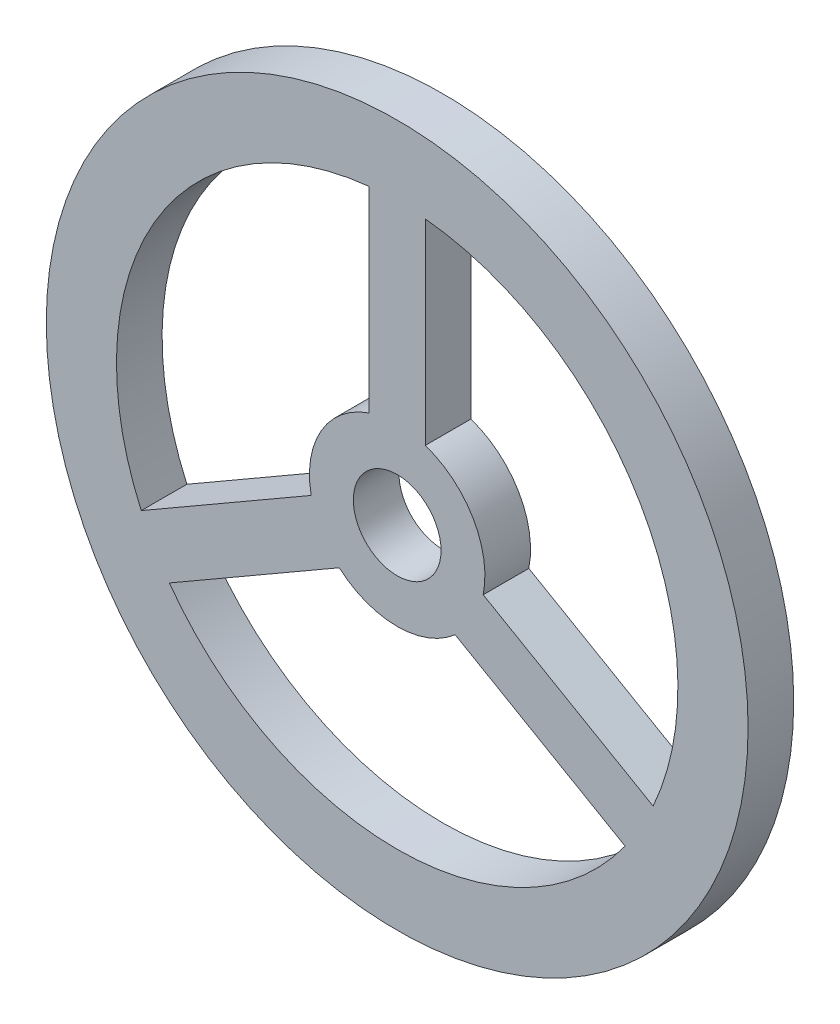
ISO-10303-21;
HEADER;
FILE_DESCRIPTION(('STEP AP214'),'2;1');
FILE_NAME('part.step','',(''),(''),'','','');
FILE_SCHEMA(('AUTOMOTIVE_DESIGN { 1 0 10303 214 1 1 1 1 }'));
ENDSEC;
DATA;
#1=APPLICATION_CONTEXT('core data for automotive mechanical design processes');
#2=APPLICATION_PROTOCOL_DEFINITION('international standard','automotive_design',2000,#1);
#3=PRODUCT_CONTEXT('',#1,'mechanical');
#4=PRODUCT('Part','Part','',(#3));
#5=PRODUCT_RELATED_PRODUCT_CATEGORY('part','',(#4));
#6=PRODUCT_DEFINITION_FORMATION('','',#4);
#7=PRODUCT_DEFINITION_CONTEXT('part definition',#1,'design');
#8=PRODUCT_DEFINITION('design','',#6,#7);
#9=PRODUCT_DEFINITION_SHAPE('','',#8);
#10=(LENGTH_UNIT() NAMED_UNIT(*) SI_UNIT(.MILLI.,.METRE.));
#11=(NAMED_UNIT(*) PLANE_ANGLE_UNIT() SI_UNIT($,.RADIAN.));
#12=(NAMED_UNIT(*) SI_UNIT($,.STERADIAN.) SOLID_ANGLE_UNIT());
#13=UNCERTAINTY_MEASURE_WITH_UNIT(LENGTH_MEASURE(1.E-05),#10,'distance_accuracy_value','');
#14=(GEOMETRIC_REPRESENTATION_CONTEXT(3) GLOBAL_UNCERTAINTY_ASSIGNED_CONTEXT((#13)) GLOBAL_UNIT_ASSIGNED_CONTEXT((#10,
#11,#12)) REPRESENTATION_CONTEXT('',''));
#15=CARTESIAN_POINT('',(0.,0.,0.));
#16=DIRECTION('',(0.,0.,1.));
#17=DIRECTION('',(1.,0.,0.));
#18=AXIS2_PLACEMENT_3D('',#15,#16,#17);
#19=CARTESIAN_POINT('',(0.,0.,1.3));
#20=DIRECTION('',(0.,0.,-1.));
#21=DIRECTION('',(-1.,0.,0.));
#22=AXIS2_PLACEMENT_3D('',#19,#20,#21);
#23=CYLINDRICAL_SURFACE('',#22,10.);
#24=CARTESIAN_POINT('',(0.,0.,1.3));
#25=DIRECTION('',(0.,0.,1.));
#26=DIRECTION('',(1.,0.,0.));
#27=AXIS2_PLACEMENT_3D('',#24,#25,#26);
#28=CIRCLE('',#27,10.);
#29=CARTESIAN_POINT('',(10.,0.,1.3));
#30=VERTEX_POINT('',#29);
#31=EDGE_CURVE('E11',#30,#30,#28,.T.);
#32=ORIENTED_EDGE('',*,*,#31,.F.);
#33=EDGE_LOOP('',(#32));
#34=FACE_BOUND('',#33,.T.);
#35=CARTESIAN_POINT('',(0.,0.,0.));
#36=DIRECTION('',(0.,0.,1.));
#37=DIRECTION('',(1.,0.,0.));
#38=AXIS2_PLACEMENT_3D('',#35,#36,#37);
#39=CIRCLE('',#38,10.);
#40=CARTESIAN_POINT('',(10.,0.,0.));
#41=VERTEX_POINT('',#40);
#42=EDGE_CURVE('E39',#41,#41,#39,.T.);
#43=ORIENTED_EDGE('',*,*,#42,.T.);
#44=EDGE_LOOP('',(#43));
#45=FACE_BOUND('',#44,.T.);
#46=ADVANCED_FACE('F36',(#34,#45),#23,.T.);
#47=CARTESIAN_POINT('',(0.,0.,1.3));
#48=DIRECTION('',(0.,0.,1.));
#49=DIRECTION('',(1.,0.,0.));
#50=AXIS2_PLACEMENT_3D('',#47,#48,#49);
#51=PLANE('',#50);
#52=CARTESIAN_POINT('',(0.,0.,1.3));
#53=DIRECTION('',(0.,0.,1.));
#54=DIRECTION('',(1.,0.,0.));
#55=AXIS2_PLACEMENT_3D('',#52,#53,#54);
#56=CIRCLE('',#55,1.25);
#57=CARTESIAN_POINT('',(1.25,0.,1.3));
#58=VERTEX_POINT('',#57);
#59=EDGE_CURVE('E151',#58,#58,#56,.T.);
#60=ORIENTED_EDGE('',*,*,#59,.F.);
#61=EDGE_LOOP('',(#60));
#62=FACE_BOUND('',#61,.T.);
#63=CARTESIAN_POINT('',(0.,0.,1.3));
#64=DIRECTION('',(0.,0.,1.));
#65=DIRECTION('',(1.,0.,0.));
#66=AXIS2_PLACEMENT_3D('',#63,#64,#65);
#67=CIRCLE('',#66,8.00000000000027);
#68=CARTESIAN_POINT('',(-6.49347517584585,-4.67277007145419,1.3));
#69=VERTEX_POINT('',#68);
#70=CARTESIAN_POINT('',(6.49347517584591,-4.6727700714541,1.3));
#71=VERTEX_POINT('',#70);
#72=EDGE_CURVE('E50',#69,#71,#67,.T.);
#73=ORIENTED_EDGE('',*,*,#72,.F.);
#74=DIRECTION('',(-0.866025403784436,-0.500000000000004,0.));
#75=VECTOR('',#74,1.);
#76=CARTESIAN_POINT('',(-6.49347517584585,-4.67277007145419,1.3));
#77=LINE('',#76,#75);
#78=CARTESIAN_POINT('',(-1.65121914967683,-1.87709225126039,1.3));
#79=VERTEX_POINT('',#78);
#80=EDGE_CURVE('E171',#79,#69,#77,.T.);
#81=ORIENTED_EDGE('',*,*,#80,.F.);
#82=CARTESIAN_POINT('',(0.,0.,1.3));
#83=DIRECTION('',(0.,0.,-1.));
#84=DIRECTION('',(1.,0.,0.));
#85=AXIS2_PLACEMENT_3D('',#82,#83,#84);
#86=CIRCLE('',#85,2.50000000000026);
#87=CARTESIAN_POINT('',(1.65121914967685,-1.87709225126037,1.3));
#88=VERTEX_POINT('',#87);
#89=EDGE_CURVE('E185',#88,#79,#86,.T.);
#90=ORIENTED_EDGE('',*,*,#89,.F.);
#91=DIRECTION('',(-0.866025403784444,0.499999999999991,0.));
#92=VECTOR('',#91,1.);
#93=CARTESIAN_POINT('',(6.49347517584591,-4.6727700714541,1.3));
#94=LINE('',#93,#92);
#95=EDGE_CURVE('E182',#71,#88,#94,.T.);
#96=ORIENTED_EDGE('',*,*,#95,.F.);
#97=EDGE_LOOP('',(#73,#81,#90,#96));
#98=FACE_BOUND('',#97,.T.);
#99=CARTESIAN_POINT('',(0.,0.,1.3));
#100=DIRECTION('',(0.,0.,-1.));
#101=DIRECTION('',(1.,0.,0.));
#102=AXIS2_PLACEMENT_3D('',#99,#100,#101);
#103=CIRCLE('',#102,2.50000000000021);
#104=CARTESIAN_POINT('',(0.800000000000001,2.36854385646557,1.3));
#105=VERTEX_POINT('',#104);
#106=CARTESIAN_POINT('',(2.45121914967684,-0.491451605205262,1.3));
#107=VERTEX_POINT('',#106);
#108=EDGE_CURVE('E58',#105,#107,#103,.T.);
#109=ORIENTED_EDGE('',*,*,#108,.F.);
#110=DIRECTION('',(0.,-1.,0.));
#111=VECTOR('',#110,1.);
#112=CARTESIAN_POINT('',(0.800000000000001,2.36854385646557,1.3));
#113=LINE('',#112,#111);
#114=CARTESIAN_POINT('',(0.800000000000007,7.95989949685317,1.3));
#115=VERTEX_POINT('',#114);
#116=EDGE_CURVE('E145',#115,#105,#113,.T.);
#117=ORIENTED_EDGE('',*,*,#116,.F.);
#118=CARTESIAN_POINT('',(0.,0.,1.3));
#119=DIRECTION('',(0.,0.,1.));
#120=DIRECTION('',(1.,0.,0.));
#121=AXIS2_PLACEMENT_3D('',#118,#119,#120);
#122=CIRCLE('',#121,8.00000000000021);
#123=CARTESIAN_POINT('',(7.2934751758459,-3.28712942539899,1.3));
#124=VERTEX_POINT('',#123);
#125=EDGE_CURVE('E148',#124,#115,#122,.T.);
#126=ORIENTED_EDGE('',*,*,#125,.F.);
#127=DIRECTION('',(0.866025403784444,-0.499999999999991,0.));
#128=VECTOR('',#127,1.);
#129=CARTESIAN_POINT('',(2.45121914967684,-0.491451605205262,1.3));
#130=LINE('',#129,#128);
#131=EDGE_CURVE('E157',#107,#124,#130,.T.);
#132=ORIENTED_EDGE('',*,*,#131,.F.);
#133=EDGE_LOOP('',(#109,#117,#126,#132));
#134=FACE_BOUND('',#133,.T.);
#135=CARTESIAN_POINT('',(0.,0.,1.3));
#136=DIRECTION('',(0.,0.,1.));
#137=DIRECTION('',(1.,0.,0.));
#138=AXIS2_PLACEMENT_3D('',#135,#136,#137);
#139=CIRCLE('',#138,8.00000000000021);
#140=CARTESIAN_POINT('',(-0.8,7.95989949685312,1.3));
#141=VERTEX_POINT('',#140);
#142=CARTESIAN_POINT('',(-7.29347517584585,-3.28712942539909,1.3));
#143=VERTEX_POINT('',#142);
#144=EDGE_CURVE('E192',#141,#143,#139,.T.);
#145=ORIENTED_EDGE('',*,*,#144,.F.);
#146=DIRECTION('',(0.,1.,0.));
#147=VECTOR('',#146,1.);
#148=CARTESIAN_POINT('',(-0.8,7.95989949685312,1.3));
#149=LINE('',#148,#147);
#150=CARTESIAN_POINT('',(-0.799999999999999,2.36854385646567,1.3));
#151=VERTEX_POINT('',#150);
#152=EDGE_CURVE('E202',#151,#141,#149,.T.);
#153=ORIENTED_EDGE('',*,*,#152,.F.);
#154=CARTESIAN_POINT('',(0.,0.,1.3));
#155=DIRECTION('',(0.,0.,-1.));
#156=DIRECTION('',(1.,0.,0.));
#157=AXIS2_PLACEMENT_3D('',#154,#155,#156);
#158=CIRCLE('',#157,2.50000000000025);
#159=CARTESIAN_POINT('',(-2.45121914967683,-0.491451605205292,1.3));
#160=VERTEX_POINT('',#159);
#161=EDGE_CURVE('E216',#160,#151,#158,.T.);
#162=ORIENTED_EDGE('',*,*,#161,.F.);
#163=DIRECTION('',(0.866025403784436,0.500000000000004,0.));
#164=VECTOR('',#163,1.);
#165=CARTESIAN_POINT('',(-7.29347517584585,-3.28712942539909,1.3));
#166=LINE('',#165,#164);
#167=EDGE_CURVE('E213',#143,#160,#166,.T.);
#168=ORIENTED_EDGE('',*,*,#167,.F.);
#169=EDGE_LOOP('',(#145,#153,#162,#168));
#170=FACE_BOUND('',#169,.T.);
#171=ORIENTED_EDGE('',*,*,#31,.T.);
#172=EDGE_LOOP('',(#171));
#173=FACE_BOUND('',#172,.T.);
#174=ADVANCED_FACE('F238',(#62,#98,#134,#170,#173),#51,.T.);
#175=CARTESIAN_POINT('',(0.,0.,0.));
#176=DIRECTION('',(0.,0.,1.));
#177=DIRECTION('',(1.,0.,0.));
#178=AXIS2_PLACEMENT_3D('',#175,#176,#177);
#179=PLANE('',#178);
#180=CARTESIAN_POINT('',(0.,0.,0.));
#181=DIRECTION('',(0.,0.,1.));
#182=DIRECTION('',(1.,0.,0.));
#183=AXIS2_PLACEMENT_3D('',#180,#181,#182);
#184=CIRCLE('',#183,1.25);
#185=CARTESIAN_POINT('',(1.25,0.,0.));
#186=VERTEX_POINT('',#185);
#187=EDGE_CURVE('E158',#186,#186,#184,.T.);
#188=ORIENTED_EDGE('',*,*,#187,.T.);
#189=EDGE_LOOP('',(#188));
#190=FACE_BOUND('',#189,.T.);
#191=DIRECTION('',(-0.866025403784436,-0.500000000000004,0.));
#192=VECTOR('',#191,1.);
#193=CARTESIAN_POINT('',(-6.49347517584585,-4.67277007145419,0.));
#194=LINE('',#193,#192);
#195=CARTESIAN_POINT('',(-1.65121914967683,-1.87709225126039,0.));
#196=VERTEX_POINT('',#195);
#197=CARTESIAN_POINT('',(-6.49347517584585,-4.67277007145419,0.));
#198=VERTEX_POINT('',#197);
#199=EDGE_CURVE('E177',#196,#198,#194,.T.);
#200=ORIENTED_EDGE('',*,*,#199,.T.);
#201=CARTESIAN_POINT('',(0.,0.,0.));
#202=DIRECTION('',(0.,0.,1.));
#203=DIRECTION('',(1.,0.,0.));
#204=AXIS2_PLACEMENT_3D('',#201,#202,#203);
#205=CIRCLE('',#204,8.00000000000027);
#206=CARTESIAN_POINT('',(6.49347517584591,-4.6727700714541,0.));
#207=VERTEX_POINT('',#206);
#208=EDGE_CURVE('E167',#198,#207,#205,.T.);
#209=ORIENTED_EDGE('',*,*,#208,.T.);
#210=DIRECTION('',(-0.866025403784444,0.499999999999991,0.));
#211=VECTOR('',#210,1.);
#212=CARTESIAN_POINT('',(6.49347517584591,-4.6727700714541,0.));
#213=LINE('',#212,#211);
#214=CARTESIAN_POINT('',(1.65121914967685,-1.87709225126037,0.));
#215=VERTEX_POINT('',#214);
#216=EDGE_CURVE('E170',#207,#215,#213,.T.);
#217=ORIENTED_EDGE('',*,*,#216,.T.);
#218=CARTESIAN_POINT('',(0.,0.,0.));
#219=DIRECTION('',(0.,0.,-1.));
#220=DIRECTION('',(1.,0.,0.));
#221=AXIS2_PLACEMENT_3D('',#218,#219,#220);
#222=CIRCLE('',#221,2.50000000000026);
#223=EDGE_CURVE('E174',#215,#196,#222,.T.);
#224=ORIENTED_EDGE('',*,*,#223,.T.);
#225=EDGE_LOOP('',(#200,#209,#217,#224));
#226=FACE_BOUND('',#225,.T.);
#227=DIRECTION('',(0.,-1.,0.));
#228=VECTOR('',#227,1.);
#229=CARTESIAN_POINT('',(0.800000000000001,2.36854385646557,0.));
#230=LINE('',#229,#228);
#231=CARTESIAN_POINT('',(0.800000000000007,7.95989949685317,0.));
#232=VERTEX_POINT('',#231);
#233=CARTESIAN_POINT('',(0.800000000000001,2.36854385646557,0.));
#234=VERTEX_POINT('',#233);
#235=EDGE_CURVE('E132',#232,#234,#230,.T.);
#236=ORIENTED_EDGE('',*,*,#235,.T.);
#237=CARTESIAN_POINT('',(0.,0.,0.));
#238=DIRECTION('',(0.,0.,-1.));
#239=DIRECTION('',(1.,0.,0.));
#240=AXIS2_PLACEMENT_3D('',#237,#238,#239);
#241=CIRCLE('',#240,2.50000000000021);
#242=CARTESIAN_POINT('',(2.45121914967684,-0.491451605205262,0.));
#243=VERTEX_POINT('',#242);
#244=EDGE_CURVE('E126',#234,#243,#241,.T.);
#245=ORIENTED_EDGE('',*,*,#244,.T.);
#246=DIRECTION('',(0.866025403784444,-0.499999999999991,0.));
#247=VECTOR('',#246,1.);
#248=CARTESIAN_POINT('',(2.45121914967684,-0.491451605205262,0.));
#249=LINE('',#248,#247);
#250=CARTESIAN_POINT('',(7.2934751758459,-3.28712942539899,0.));
#251=VERTEX_POINT('',#250);
#252=EDGE_CURVE('E136',#243,#251,#249,.T.);
#253=ORIENTED_EDGE('',*,*,#252,.T.);
#254=CARTESIAN_POINT('',(0.,0.,0.));
#255=DIRECTION('',(0.,0.,1.));
#256=DIRECTION('',(1.,0.,0.));
#257=AXIS2_PLACEMENT_3D('',#254,#255,#256);
#258=CIRCLE('',#257,8.00000000000021);
#259=EDGE_CURVE('E140',#251,#232,#258,.T.);
#260=ORIENTED_EDGE('',*,*,#259,.T.);
#261=EDGE_LOOP('',(#236,#245,#253,#260));
#262=FACE_BOUND('',#261,.T.);
#263=DIRECTION('',(0.,1.,0.));
#264=VECTOR('',#263,1.);
#265=CARTESIAN_POINT('',(-0.8,7.95989949685312,0.));
#266=LINE('',#265,#264);
#267=CARTESIAN_POINT('',(-0.799999999999999,2.36854385646567,0.));
#268=VERTEX_POINT('',#267);
#269=CARTESIAN_POINT('',(-0.8,7.95989949685312,0.));
#270=VERTEX_POINT('',#269);
#271=EDGE_CURVE('E208',#268,#270,#266,.T.);
#272=ORIENTED_EDGE('',*,*,#271,.T.);
#273=CARTESIAN_POINT('',(0.,0.,0.));
#274=DIRECTION('',(0.,0.,1.));
#275=DIRECTION('',(1.,0.,0.));
#276=AXIS2_PLACEMENT_3D('',#273,#274,#275);
#277=CIRCLE('',#276,8.00000000000021);
#278=CARTESIAN_POINT('',(-7.29347517584585,-3.28712942539909,0.));
#279=VERTEX_POINT('',#278);
#280=EDGE_CURVE('E198',#270,#279,#277,.T.);
#281=ORIENTED_EDGE('',*,*,#280,.T.);
#282=DIRECTION('',(0.866025403784436,0.500000000000004,0.));
#283=VECTOR('',#282,1.);
#284=CARTESIAN_POINT('',(-7.29347517584585,-3.28712942539909,0.));
#285=LINE('',#284,#283);
#286=CARTESIAN_POINT('',(-2.45121914967683,-0.491451605205293,0.));
#287=VERTEX_POINT('',#286);
#288=EDGE_CURVE('E201',#279,#287,#285,.T.);
#289=ORIENTED_EDGE('',*,*,#288,.T.);
#290=CARTESIAN_POINT('',(0.,0.,0.));
#291=DIRECTION('',(0.,0.,-1.));
#292=DIRECTION('',(1.,0.,0.));
#293=AXIS2_PLACEMENT_3D('',#290,#291,#292);
#294=CIRCLE('',#293,2.50000000000025);
#295=EDGE_CURVE('E205',#287,#268,#294,.T.);
#296=ORIENTED_EDGE('',*,*,#295,.T.);
#297=EDGE_LOOP('',(#272,#281,#289,#296));
#298=FACE_BOUND('',#297,.T.);
#299=ORIENTED_EDGE('',*,*,#42,.F.);
#300=EDGE_LOOP('',(#299));
#301=FACE_BOUND('',#300,.T.);
#302=ADVANCED_FACE('F142',(#190,#226,#262,#298,#301),#179,.F.);
#303=CARTESIAN_POINT('',(0.,0.,0.));
#304=DIRECTION('',(0.,0.,1.));
#305=DIRECTION('',(1.,0.,0.));
#306=AXIS2_PLACEMENT_3D('',#303,#304,#305);
#307=CYLINDRICAL_SURFACE('',#306,8.00000000000021);
#308=ORIENTED_EDGE('',*,*,#144,.T.);
#309=DIRECTION('',(0.,0.,1.));
#310=VECTOR('',#309,1.);
#311=CARTESIAN_POINT('',(-7.29347517584585,-3.28712942539909,0.));
#312=LINE('',#311,#310);
#313=EDGE_CURVE('E211',#279,#143,#312,.T.);
#314=ORIENTED_EDGE('',*,*,#313,.F.);
#315=ORIENTED_EDGE('',*,*,#280,.F.);
#316=DIRECTION('',(0.,0.,1.));
#317=VECTOR('',#316,1.);
#318=CARTESIAN_POINT('',(-0.8,7.95989949685312,0.));
#319=LINE('',#318,#317);
#320=EDGE_CURVE('E221',#270,#141,#319,.T.);
#321=ORIENTED_EDGE('',*,*,#320,.T.);
#322=EDGE_LOOP('',(#308,#314,#315,#321));
#323=FACE_BOUND('',#322,.T.);
#324=ADVANCED_FACE('F245',(#323),#307,.F.);
#325=CARTESIAN_POINT('',(-0.8,7.95989949685312,0.));
#326=DIRECTION('',(1.,0.,0.));
#327=DIRECTION('',(0.,1.,0.));
#328=AXIS2_PLACEMENT_3D('',#325,#326,#327);
#329=PLANE('',#328);
#330=ORIENTED_EDGE('',*,*,#152,.T.);
#331=ORIENTED_EDGE('',*,*,#320,.F.);
#332=ORIENTED_EDGE('',*,*,#271,.F.);
#333=DIRECTION('',(0.,0.,1.));
#334=VECTOR('',#333,1.);
#335=CARTESIAN_POINT('',(-0.799999999999999,2.36854385646567,0.));
#336=LINE('',#335,#334);
#337=EDGE_CURVE('E223',#268,#151,#336,.T.);
#338=ORIENTED_EDGE('',*,*,#337,.T.);
#339=EDGE_LOOP('',(#330,#331,#332,#338));
#340=FACE_BOUND('',#339,.T.);
#341=ADVANCED_FACE('F247',(#340),#329,.F.);
#342=CARTESIAN_POINT('',(0.,0.,0.));
#343=DIRECTION('',(0.,0.,1.));
#344=DIRECTION('',(1.,0.,0.));
#345=AXIS2_PLACEMENT_3D('',#342,#343,#344);
#346=CYLINDRICAL_SURFACE('',#345,2.50000000000025);
#347=ORIENTED_EDGE('',*,*,#161,.T.);
#348=ORIENTED_EDGE('',*,*,#337,.F.);
#349=ORIENTED_EDGE('',*,*,#295,.F.);
#350=DIRECTION('',(0.,0.,1.));
#351=VECTOR('',#350,1.);
#352=CARTESIAN_POINT('',(-2.45121914967683,-0.491451605205292,0.));
#353=LINE('',#352,#351);
#354=EDGE_CURVE('E225',#287,#160,#353,.T.);
#355=ORIENTED_EDGE('',*,*,#354,.T.);
#356=EDGE_LOOP('',(#347,#348,#349,#355));
#357=FACE_BOUND('',#356,.T.);
#358=ADVANCED_FACE('F242',(#357),#346,.T.);
#359=CARTESIAN_POINT('',(-7.29347517584585,-3.28712942539909,0.));
#360=DIRECTION('',(0.500000000000004,-0.866025403784436,0.));
#361=DIRECTION('',(0.866025403784436,0.500000000000004,0.));
#362=AXIS2_PLACEMENT_3D('',#359,#360,#361);
#363=PLANE('',#362);
#364=ORIENTED_EDGE('',*,*,#167,.T.);
#365=ORIENTED_EDGE('',*,*,#354,.F.);
#366=ORIENTED_EDGE('',*,*,#288,.F.);
#367=ORIENTED_EDGE('',*,*,#313,.T.);
#368=EDGE_LOOP('',(#364,#365,#366,#367));
#369=FACE_BOUND('',#368,.T.);
#370=ADVANCED_FACE('F231',(#369),#363,.F.);
#371=CARTESIAN_POINT('',(0.,0.,0.));
#372=DIRECTION('',(0.,0.,1.));
#373=DIRECTION('',(1.,0.,0.));
#374=AXIS2_PLACEMENT_3D('',#371,#372,#373);
#375=CYLINDRICAL_SURFACE('',#374,2.50000000000021);
#376=ORIENTED_EDGE('',*,*,#108,.T.);
#377=DIRECTION('',(0.,0.,1.));
#378=VECTOR('',#377,1.);
#379=CARTESIAN_POINT('',(2.45121914967684,-0.491451605205262,0.));
#380=LINE('',#379,#378);
#381=EDGE_CURVE('E122',#243,#107,#380,.T.);
#382=ORIENTED_EDGE('',*,*,#381,.F.);
#383=ORIENTED_EDGE('',*,*,#244,.F.);
#384=DIRECTION('',(0.,0.,1.));
#385=VECTOR('',#384,1.);
#386=CARTESIAN_POINT('',(0.800000000000001,2.36854385646557,0.));
#387=LINE('',#386,#385);
#388=EDGE_CURVE('E162',#234,#105,#387,.T.);
#389=ORIENTED_EDGE('',*,*,#388,.T.);
#390=EDGE_LOOP('',(#376,#382,#383,#389));
#391=FACE_BOUND('',#390,.T.);
#392=ADVANCED_FACE('F124',(#391),#375,.T.);
#393=CARTESIAN_POINT('',(0.800000000000001,2.36854385646557,0.));
#394=DIRECTION('',(-1.,0.,0.));
#395=DIRECTION('',(0.,0.,1.));
#396=AXIS2_PLACEMENT_3D('',#393,#394,#395);
#397=PLANE('',#396);
#398=ORIENTED_EDGE('',*,*,#116,.T.);
#399=ORIENTED_EDGE('',*,*,#388,.F.);
#400=ORIENTED_EDGE('',*,*,#235,.F.);
#401=DIRECTION('',(0.,0.,1.));
#402=VECTOR('',#401,1.);
#403=CARTESIAN_POINT('',(0.800000000000007,7.95989949685317,0.));
#404=LINE('',#403,#402);
#405=EDGE_CURVE('E164',#232,#115,#404,.T.);
#406=ORIENTED_EDGE('',*,*,#405,.T.);
#407=EDGE_LOOP('',(#398,#399,#400,#406));
#408=FACE_BOUND('',#407,.T.);
#409=ADVANCED_FACE('F279',(#408),#397,.F.);
#410=CARTESIAN_POINT('',(0.,0.,0.));
#411=DIRECTION('',(0.,0.,1.));
#412=DIRECTION('',(1.,0.,0.));
#413=AXIS2_PLACEMENT_3D('',#410,#411,#412);
#414=CYLINDRICAL_SURFACE('',#413,8.00000000000021);
#415=ORIENTED_EDGE('',*,*,#125,.T.);
#416=ORIENTED_EDGE('',*,*,#405,.F.);
#417=ORIENTED_EDGE('',*,*,#259,.F.);
#418=DIRECTION('',(0.,0.,1.));
#419=VECTOR('',#418,1.);
#420=CARTESIAN_POINT('',(7.2934751758459,-3.28712942539899,0.));
#421=LINE('',#420,#419);
#422=EDGE_CURVE('E131',#251,#124,#421,.T.);
#423=ORIENTED_EDGE('',*,*,#422,.T.);
#424=EDGE_LOOP('',(#415,#416,#417,#423));
#425=FACE_BOUND('',#424,.T.);
#426=ADVANCED_FACE('F284',(#425),#414,.F.);
#427=CARTESIAN_POINT('',(2.45121914967684,-0.491451605205262,0.));
#428=DIRECTION('',(-0.499999999999991,-0.866025403784444,0.));
#429=DIRECTION('',(0.866025403784444,-0.499999999999991,0.));
#430=AXIS2_PLACEMENT_3D('',#427,#428,#429);
#431=PLANE('',#430);
#432=ORIENTED_EDGE('',*,*,#131,.T.);
#433=ORIENTED_EDGE('',*,*,#422,.F.);
#434=ORIENTED_EDGE('',*,*,#252,.F.);
#435=ORIENTED_EDGE('',*,*,#381,.T.);
#436=EDGE_LOOP('',(#432,#433,#434,#435));
#437=FACE_BOUND('',#436,.T.);
#438=ADVANCED_FACE('F137',(#437),#431,.F.);
#439=CARTESIAN_POINT('',(0.,0.,0.));
#440=DIRECTION('',(0.,0.,1.));
#441=DIRECTION('',(1.,0.,0.));
#442=AXIS2_PLACEMENT_3D('',#439,#440,#441);
#443=CYLINDRICAL_SURFACE('',#442,8.00000000000027);
#444=ORIENTED_EDGE('',*,*,#72,.T.);
#445=DIRECTION('',(0.,0.,1.));
#446=VECTOR('',#445,1.);
#447=CARTESIAN_POINT('',(6.49347517584591,-4.6727700714541,0.));
#448=LINE('',#447,#446);
#449=EDGE_CURVE('E180',#207,#71,#448,.T.);
#450=ORIENTED_EDGE('',*,*,#449,.F.);
#451=ORIENTED_EDGE('',*,*,#208,.F.);
#452=DIRECTION('',(0.,0.,1.));
#453=VECTOR('',#452,1.);
#454=CARTESIAN_POINT('',(-6.49347517584585,-4.67277007145419,0.));
#455=LINE('',#454,#453);
#456=EDGE_CURVE('E190',#198,#69,#455,.T.);
#457=ORIENTED_EDGE('',*,*,#456,.T.);
#458=EDGE_LOOP('',(#444,#450,#451,#457));
#459=FACE_BOUND('',#458,.T.);
#460=ADVANCED_FACE('F294',(#459),#443,.F.);
#461=CARTESIAN_POINT('',(-6.49347517584585,-4.67277007145419,0.));
#462=DIRECTION('',(-0.500000000000004,0.866025403784436,0.));
#463=DIRECTION('',(-0.866025403784436,-0.500000000000004,0.));
#464=AXIS2_PLACEMENT_3D('',#461,#462,#463);
#465=PLANE('',#464);
#466=ORIENTED_EDGE('',*,*,#80,.T.);
#467=ORIENTED_EDGE('',*,*,#456,.F.);
#468=ORIENTED_EDGE('',*,*,#199,.F.);
#469=DIRECTION('',(0.,0.,1.));
#470=VECTOR('',#469,1.);
#471=CARTESIAN_POINT('',(-1.65121914967683,-1.87709225126039,0.));
#472=LINE('',#471,#470);
#473=EDGE_CURVE('E193',#196,#79,#472,.T.);
#474=ORIENTED_EDGE('',*,*,#473,.T.);
#475=EDGE_LOOP('',(#466,#467,#468,#474));
#476=FACE_BOUND('',#475,.T.);
#477=ADVANCED_FACE('F290',(#476),#465,.F.);
#478=CARTESIAN_POINT('',(0.,0.,0.));
#479=DIRECTION('',(0.,0.,1.));
#480=DIRECTION('',(1.,0.,0.));
#481=AXIS2_PLACEMENT_3D('',#478,#479,#480);
#482=CYLINDRICAL_SURFACE('',#481,2.50000000000026);
#483=ORIENTED_EDGE('',*,*,#89,.T.);
#484=ORIENTED_EDGE('',*,*,#473,.F.);
#485=ORIENTED_EDGE('',*,*,#223,.F.);
#486=DIRECTION('',(0.,0.,1.));
#487=VECTOR('',#486,1.);
#488=CARTESIAN_POINT('',(1.65121914967685,-1.87709225126037,0.));
#489=LINE('',#488,#487);
#490=EDGE_CURVE('E195',#215,#88,#489,.T.);
#491=ORIENTED_EDGE('',*,*,#490,.T.);
#492=EDGE_LOOP('',(#483,#484,#485,#491));
#493=FACE_BOUND('',#492,.T.);
#494=ADVANCED_FACE('F293',(#493),#482,.T.);
#495=CARTESIAN_POINT('',(6.49347517584591,-4.6727700714541,0.));
#496=DIRECTION('',(0.499999999999991,0.866025403784444,0.));
#497=DIRECTION('',(-0.866025403784444,0.499999999999991,0.));
#498=AXIS2_PLACEMENT_3D('',#495,#496,#497);
#499=PLANE('',#498);
#500=ORIENTED_EDGE('',*,*,#95,.T.);
#501=ORIENTED_EDGE('',*,*,#490,.F.);
#502=ORIENTED_EDGE('',*,*,#216,.F.);
#503=ORIENTED_EDGE('',*,*,#449,.T.);
#504=EDGE_LOOP('',(#500,#501,#502,#503));
#505=FACE_BOUND('',#504,.T.);
#506=ADVANCED_FACE('F298',(#505),#499,.F.);
#507=CARTESIAN_POINT('',(0.,0.,0.));
#508=DIRECTION('',(0.,0.,1.));
#509=DIRECTION('',(1.,0.,0.));
#510=AXIS2_PLACEMENT_3D('',#507,#508,#509);
#511=CYLINDRICAL_SURFACE('',#510,1.25);
#512=ORIENTED_EDGE('',*,*,#187,.F.);
#513=EDGE_LOOP('',(#512));
#514=FACE_BOUND('',#513,.T.);
#515=ORIENTED_EDGE('',*,*,#59,.T.);
#516=EDGE_LOOP('',(#515));
#517=FACE_BOUND('',#516,.T.);
#518=ADVANCED_FACE('F301',(#514,#517),#511,.F.);
#519=CLOSED_SHELL('',(#46,#174,#302,#324,#341,#358,#370,#392,#409,#426,#438,#460,#477,#494,#506,#518));
#520=MANIFOLD_SOLID_BREP('B2',#519);
#521=ADVANCED_BREP_SHAPE_REPRESENTATION('',(#18,#520),#14);
#522=SHAPE_DEFINITION_REPRESENTATION(#9,#521);
ENDSEC;
END-ISO-10303-21;
